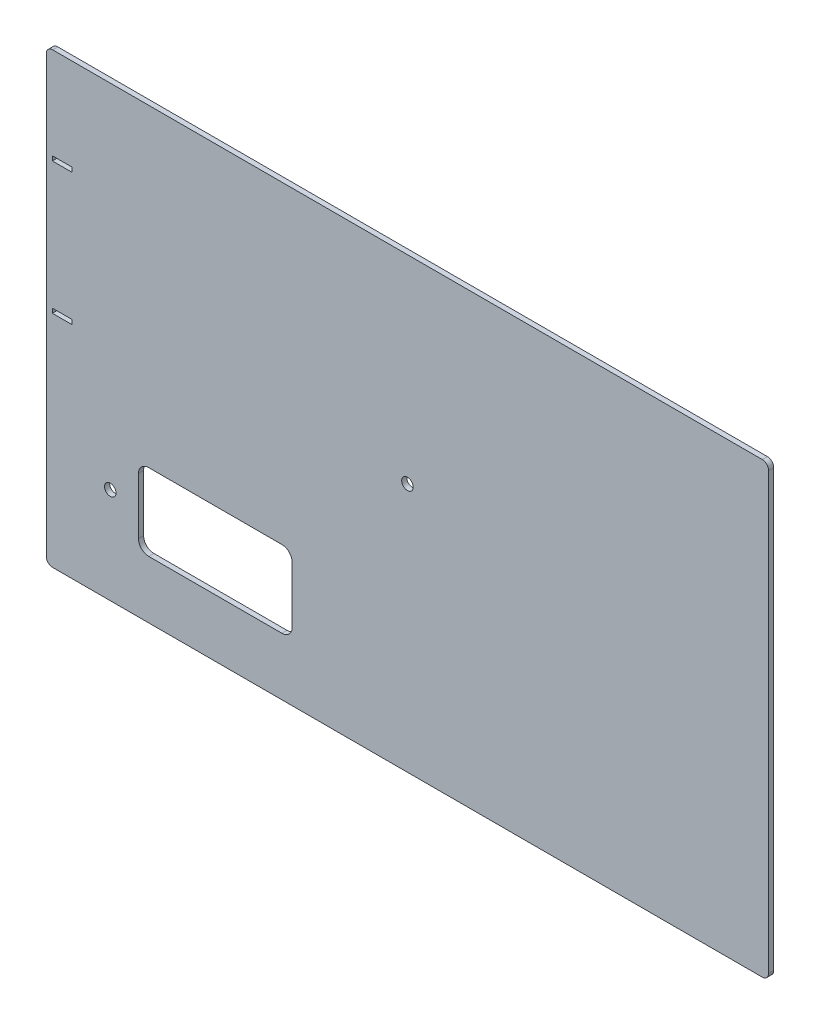
ISO-10303-21;
HEADER;
FILE_DESCRIPTION(('STEP AP214'),'2;1');
FILE_NAME('part.step','',(''),(''),'','','');
FILE_SCHEMA(('AUTOMOTIVE_DESIGN { 1 0 10303 214 1 1 1 1 }'));
ENDSEC;
DATA;
#1=APPLICATION_CONTEXT('core data for automotive mechanical design processes');
#2=APPLICATION_PROTOCOL_DEFINITION('international standard','automotive_design',2000,#1);
#3=PRODUCT_CONTEXT('',#1,'mechanical');
#4=PRODUCT('Part','Part','',(#3));
#5=PRODUCT_RELATED_PRODUCT_CATEGORY('part','',(#4));
#6=PRODUCT_DEFINITION_FORMATION('','',#4);
#7=PRODUCT_DEFINITION_CONTEXT('part definition',#1,'design');
#8=PRODUCT_DEFINITION('design','',#6,#7);
#9=PRODUCT_DEFINITION_SHAPE('','',#8);
#10=(LENGTH_UNIT() NAMED_UNIT(*) SI_UNIT(.MILLI.,.METRE.));
#11=(NAMED_UNIT(*) PLANE_ANGLE_UNIT() SI_UNIT($,.RADIAN.));
#12=(NAMED_UNIT(*) SI_UNIT($,.STERADIAN.) SOLID_ANGLE_UNIT());
#13=UNCERTAINTY_MEASURE_WITH_UNIT(LENGTH_MEASURE(1.E-05),#10,'distance_accuracy_value','');
#14=(GEOMETRIC_REPRESENTATION_CONTEXT(3) GLOBAL_UNCERTAINTY_ASSIGNED_CONTEXT((#13)) GLOBAL_UNIT_ASSIGNED_CONTEXT((#10,
#11,#12)) REPRESENTATION_CONTEXT('',''));
#15=CARTESIAN_POINT('',(0.,0.,0.));
#16=DIRECTION('',(0.,0.,1.));
#17=DIRECTION('',(1.,0.,0.));
#18=AXIS2_PLACEMENT_3D('',#15,#16,#17);
#19=CARTESIAN_POINT('',(0.,0.,-4.));
#20=DIRECTION('',(0.,0.,1.));
#21=DIRECTION('',(1.,0.,0.));
#22=AXIS2_PLACEMENT_3D('',#19,#20,#21);
#23=PLANE('',#22);
#24=CARTESIAN_POINT('',(-261.75,0.249999999999966,-3.99999999999997));
#25=CARTESIAN_POINT('',(-261.75,-3.25000000000003,-3.99999999999997));
#26=B_SPLINE_CURVE_WITH_KNOTS('',1,(#24,#25),.UNSPECIFIED.,.F.,.F.,(2,2),(0.5,
0.592105263157895),.UNSPECIFIED.);
#27=CARTESIAN_POINT('',(-261.75,0.249999999999966,-3.99999999999997));
#28=VERTEX_POINT('',#27);
#29=CARTESIAN_POINT('',(-261.75,-3.25000000000003,-3.99999999999997));
#30=VERTEX_POINT('',#29);
#31=EDGE_CURVE('E224',#28,#30,#26,.T.);
#32=ORIENTED_EDGE('',*,*,#31,.F.);
#33=CARTESIAN_POINT('',(-277.25,0.249999999999966,-3.99999999999997));
#34=CARTESIAN_POINT('',(-261.75,0.249999999999966,-3.99999999999997));
#35=B_SPLINE_CURVE_WITH_KNOTS('',1,(#33,#34),.UNSPECIFIED.,.F.,.F.,(2,2),(0.0921052631578947,
0.5),.UNSPECIFIED.);
#36=CARTESIAN_POINT('',(-277.25,0.249999999999966,-3.99999999999997));
#37=VERTEX_POINT('',#36);
#38=EDGE_CURVE('E217',#37,#28,#35,.T.);
#39=ORIENTED_EDGE('',*,*,#38,.F.);
#40=CARTESIAN_POINT('',(-277.25,-3.25000000000003,-3.99999999999997));
#41=CARTESIAN_POINT('',(-277.25,0.249999999999966,-3.99999999999997));
#42=B_SPLINE_CURVE_WITH_KNOTS('',1,(#40,#41),.UNSPECIFIED.,.F.,.F.,(2,2),(0.,
0.0921052631578947),.UNSPECIFIED.);
#43=CARTESIAN_POINT('',(-277.25,-3.25000000000005,-4.));
#44=VERTEX_POINT('',#43);
#45=EDGE_CURVE('E228',#44,#37,#42,.T.);
#46=ORIENTED_EDGE('',*,*,#45,.F.);
#47=CARTESIAN_POINT('',(-261.75,-3.25000000000003,-3.99999999999997));
#48=CARTESIAN_POINT('',(-277.25,-3.25000000000003,-3.99999999999997));
#49=B_SPLINE_CURVE_WITH_KNOTS('',1,(#47,#48),.UNSPECIFIED.,.F.,.F.,(2,2),(0.592105263157895,1.),.UNSPECIFIED.);
#50=EDGE_CURVE('E55',#30,#44,#49,.T.);
#51=ORIENTED_EDGE('',*,*,#50,.F.);
#52=EDGE_LOOP('',(#32,#39,#46,#51));
#53=FACE_BOUND('',#52,.T.);
#54=DIRECTION('',(1.,0.,0.));
#55=VECTOR('',#54,1.);
#56=CARTESIAN_POINT('',(-282.,-175.,-4.));
#57=LINE('',#56,#55);
#58=CARTESIAN_POINT('',(-277.,-175.,-4.));
#59=VERTEX_POINT('',#58);
#60=CARTESIAN_POINT('',(277.,-175.,-4.));
#61=VERTEX_POINT('',#60);
#62=EDGE_CURVE('E357',#59,#61,#57,.T.);
#63=ORIENTED_EDGE('',*,*,#62,.F.);
#64=CARTESIAN_POINT('',(-277.,-170.,-4.));
#65=DIRECTION('',(0.,0.,1.));
#66=DIRECTION('',(1.,0.,0.));
#67=AXIS2_PLACEMENT_3D('',#64,#65,#66);
#68=CIRCLE('',#67,5.);
#69=CARTESIAN_POINT('',(-282.,-170.,-4.));
#70=VERTEX_POINT('',#69);
#71=EDGE_CURVE('E398',#59,#70,#68,.F.);
#72=ORIENTED_EDGE('',*,*,#71,.T.);
#73=DIRECTION('',(0.,-1.,0.));
#74=VECTOR('',#73,1.);
#75=CARTESIAN_POINT('',(-282.,175.,-4.));
#76=LINE('',#75,#74);
#77=CARTESIAN_POINT('',(-282.,170.,-4.));
#78=VERTEX_POINT('',#77);
#79=EDGE_CURVE('E374',#78,#70,#76,.T.);
#80=ORIENTED_EDGE('',*,*,#79,.F.);
#81=CARTESIAN_POINT('',(-277.,170.,-4.));
#82=DIRECTION('',(0.,0.,1.));
#83=DIRECTION('',(1.,0.,0.));
#84=AXIS2_PLACEMENT_3D('',#81,#82,#83);
#85=CIRCLE('',#84,5.);
#86=CARTESIAN_POINT('',(-277.,175.,-4.));
#87=VERTEX_POINT('',#86);
#88=EDGE_CURVE('E394',#78,#87,#85,.F.);
#89=ORIENTED_EDGE('',*,*,#88,.T.);
#90=DIRECTION('',(-1.,0.,0.));
#91=VECTOR('',#90,1.);
#92=CARTESIAN_POINT('',(-282.,175.,-4.));
#93=LINE('',#92,#91);
#94=CARTESIAN_POINT('',(277.,175.,-4.));
#95=VERTEX_POINT('',#94);
#96=EDGE_CURVE('E356',#95,#87,#93,.T.);
#97=ORIENTED_EDGE('',*,*,#96,.F.);
#98=CARTESIAN_POINT('',(277.,170.,-4.));
#99=DIRECTION('',(0.,0.,1.));
#100=DIRECTION('',(1.,0.,0.));
#101=AXIS2_PLACEMENT_3D('',#98,#99,#100);
#102=CIRCLE('',#101,5.);
#103=CARTESIAN_POINT('',(282.,170.,-4.));
#104=VERTEX_POINT('',#103);
#105=EDGE_CURVE('E392',#95,#104,#102,.F.);
#106=ORIENTED_EDGE('',*,*,#105,.T.);
#107=DIRECTION('',(0.,1.,0.));
#108=VECTOR('',#107,1.);
#109=CARTESIAN_POINT('',(282.,175.,-4.));
#110=LINE('',#109,#108);
#111=CARTESIAN_POINT('',(282.,-170.,-4.));
#112=VERTEX_POINT('',#111);
#113=EDGE_CURVE('E352',#112,#104,#110,.T.);
#114=ORIENTED_EDGE('',*,*,#113,.F.);
#115=CARTESIAN_POINT('',(277.,-170.,-4.));
#116=DIRECTION('',(0.,0.,1.));
#117=DIRECTION('',(1.,0.,0.));
#118=AXIS2_PLACEMENT_3D('',#115,#116,#117);
#119=CIRCLE('',#118,5.);
#120=EDGE_CURVE('E396',#112,#61,#119,.F.);
#121=ORIENTED_EDGE('',*,*,#120,.T.);
#122=EDGE_LOOP('',(#63,#72,#80,#89,#97,#106,#114,#121));
#123=FACE_BOUND('',#122,.T.);
#124=CARTESIAN_POINT('',(-1.11022302462516E-13,20.,-4.));
#125=DIRECTION('',(0.,0.,1.));
#126=DIRECTION('',(1.,0.,0.));
#127=AXIS2_PLACEMENT_3D('',#124,#125,#126);
#128=CIRCLE('',#127,4.5);
#129=CARTESIAN_POINT('',(4.49999999999989,20.,-4.));
#130=VERTEX_POINT('',#129);
#131=EDGE_CURVE('E341',#130,#130,#128,.T.);
#132=ORIENTED_EDGE('',*,*,#131,.T.);
#133=EDGE_LOOP('',(#132));
#134=FACE_BOUND('',#133,.T.);
#135=DIRECTION('',(1.,0.,0.));
#136=VECTOR('',#135,1.);
#137=CARTESIAN_POINT('',(-202.,-70.,-4.));
#138=LINE('',#137,#136);
#139=CARTESIAN_POINT('',(-202.,-70.,-4.));
#140=VERTEX_POINT('',#139);
#141=CARTESIAN_POINT('',(-98.,-70.,-4.));
#142=VERTEX_POINT('',#141);
#143=EDGE_CURVE('E305',#140,#142,#138,.T.);
#144=ORIENTED_EDGE('',*,*,#143,.F.);
#145=CARTESIAN_POINT('',(-202.,-78.,-4.));
#146=DIRECTION('',(0.,0.,-1.));
#147=DIRECTION('',(-1.,0.,0.));
#148=AXIS2_PLACEMENT_3D('',#145,#146,#147);
#149=CIRCLE('',#148,8.00000000000001);
#150=CARTESIAN_POINT('',(-210.,-78.,-4.));
#151=VERTEX_POINT('',#150);
#152=EDGE_CURVE('E300',#151,#140,#149,.T.);
#153=ORIENTED_EDGE('',*,*,#152,.F.);
#154=DIRECTION('',(0.,1.,0.));
#155=VECTOR('',#154,1.);
#156=CARTESIAN_POINT('',(-210.,-122.,-4.));
#157=LINE('',#156,#155);
#158=CARTESIAN_POINT('',(-210.,-122.,-4.));
#159=VERTEX_POINT('',#158);
#160=EDGE_CURVE('E316',#159,#151,#157,.T.);
#161=ORIENTED_EDGE('',*,*,#160,.F.);
#162=CARTESIAN_POINT('',(-202.,-122.,-4.));
#163=DIRECTION('',(0.,0.,-1.));
#164=DIRECTION('',(-1.,0.,0.));
#165=AXIS2_PLACEMENT_3D('',#162,#163,#164);
#166=CIRCLE('',#165,8.00000000000001);
#167=CARTESIAN_POINT('',(-202.,-130.,-4.));
#168=VERTEX_POINT('',#167);
#169=EDGE_CURVE('E321',#168,#159,#166,.T.);
#170=ORIENTED_EDGE('',*,*,#169,.F.);
#171=DIRECTION('',(-1.,0.,0.));
#172=VECTOR('',#171,1.);
#173=CARTESIAN_POINT('',(-98.,-130.,-4.));
#174=LINE('',#173,#172);
#175=CARTESIAN_POINT('',(-98.,-130.,-4.));
#176=VERTEX_POINT('',#175);
#177=EDGE_CURVE('E454',#176,#168,#174,.T.);
#178=ORIENTED_EDGE('',*,*,#177,.F.);
#179=CARTESIAN_POINT('',(-98.,-122.,-4.));
#180=DIRECTION('',(0.,0.,-1.));
#181=DIRECTION('',(-1.,0.,0.));
#182=AXIS2_PLACEMENT_3D('',#179,#180,#181);
#183=CIRCLE('',#182,8.00000000000001);
#184=CARTESIAN_POINT('',(-90.,-122.,-4.));
#185=VERTEX_POINT('',#184);
#186=EDGE_CURVE('E449',#185,#176,#183,.T.);
#187=ORIENTED_EDGE('',*,*,#186,.F.);
#188=DIRECTION('',(0.,-1.,0.));
#189=VECTOR('',#188,1.);
#190=CARTESIAN_POINT('',(-90.,-78.,-4.));
#191=LINE('',#190,#189);
#192=CARTESIAN_POINT('',(-90.,-78.,-4.));
#193=VERTEX_POINT('',#192);
#194=EDGE_CURVE('E455',#193,#185,#191,.T.);
#195=ORIENTED_EDGE('',*,*,#194,.F.);
#196=CARTESIAN_POINT('',(-98.,-78.,-4.));
#197=DIRECTION('',(0.,0.,-1.));
#198=DIRECTION('',(-1.,0.,0.));
#199=AXIS2_PLACEMENT_3D('',#196,#197,#198);
#200=CIRCLE('',#199,8.00000000000001);
#201=EDGE_CURVE('E465',#142,#193,#200,.T.);
#202=ORIENTED_EDGE('',*,*,#201,.F.);
#203=EDGE_LOOP('',(#144,#153,#161,#170,#178,#187,#195,#202));
#204=FACE_BOUND('',#203,.T.);
#205=CARTESIAN_POINT('',(-232.,-100.,-4.));
#206=DIRECTION('',(0.,0.,-1.));
#207=DIRECTION('',(-1.,0.,0.));
#208=AXIS2_PLACEMENT_3D('',#205,#206,#207);
#209=CIRCLE('',#208,4.50000000000002);
#210=CARTESIAN_POINT('',(-236.5,-100.,-4.));
#211=VERTEX_POINT('',#210);
#212=EDGE_CURVE('E296',#211,#211,#209,.T.);
#213=ORIENTED_EDGE('',*,*,#212,.F.);
#214=EDGE_LOOP('',(#213));
#215=FACE_BOUND('',#214,.T.);
#216=CARTESIAN_POINT('',(-277.25,103.25,-3.99999999999993));
#217=CARTESIAN_POINT('',(-277.25,99.75,-3.99999999999993));
#218=B_SPLINE_CURVE_WITH_KNOTS('',1,(#216,#217),.UNSPECIFIED.,.F.,.F.,(2,2),(0.,
0.0921052631578947),.UNSPECIFIED.);
#219=CARTESIAN_POINT('',(-277.25,103.25,-4.));
#220=VERTEX_POINT('',#219);
#221=CARTESIAN_POINT('',(-277.25,99.75,-3.99999999999993));
#222=VERTEX_POINT('',#221);
#223=EDGE_CURVE('E271',#220,#222,#218,.T.);
#224=ORIENTED_EDGE('',*,*,#223,.T.);
#225=CARTESIAN_POINT('',(-277.25,99.75,-3.99999999999993));
#226=CARTESIAN_POINT('',(-261.75,99.75,-3.99999999999993));
#227=B_SPLINE_CURVE_WITH_KNOTS('',1,(#225,#226),.UNSPECIFIED.,.F.,.F.,(2,2),(0.0921052631578947,
0.5),.UNSPECIFIED.);
#228=CARTESIAN_POINT('',(-261.75,99.75,-3.99999999999993));
#229=VERTEX_POINT('',#228);
#230=EDGE_CURVE('E258',#222,#229,#227,.T.);
#231=ORIENTED_EDGE('',*,*,#230,.T.);
#232=CARTESIAN_POINT('',(-261.75,99.75,-3.99999999999993));
#233=CARTESIAN_POINT('',(-261.75,103.25,-3.99999999999993));
#234=B_SPLINE_CURVE_WITH_KNOTS('',1,(#232,#233),.UNSPECIFIED.,.F.,.F.,(2,2),(0.5,
0.592105263157895),.UNSPECIFIED.);
#235=CARTESIAN_POINT('',(-261.75,103.25,-3.99999999999993));
#236=VERTEX_POINT('',#235);
#237=EDGE_CURVE('E248',#229,#236,#234,.T.);
#238=ORIENTED_EDGE('',*,*,#237,.T.);
#239=CARTESIAN_POINT('',(-261.75,103.25,-3.99999999999993));
#240=CARTESIAN_POINT('',(-277.25,103.25,-3.99999999999993));
#241=B_SPLINE_CURVE_WITH_KNOTS('',1,(#239,#240),.UNSPECIFIED.,.F.,.F.,(2,2),(0.592105263157895,
1.),.UNSPECIFIED.);
#242=EDGE_CURVE('E240',#236,#220,#241,.T.);
#243=ORIENTED_EDGE('',*,*,#242,.T.);
#244=EDGE_LOOP('',(#224,#231,#238,#243));
#245=FACE_BOUND('',#244,.T.);
#246=ADVANCED_FACE('F40',(#53,#123,#134,#204,#215,#245),#23,.F.);
#247=CARTESIAN_POINT('',(0.,0.,0.));
#248=DIRECTION('',(0.,0.,1.));
#249=DIRECTION('',(1.,0.,0.));
#250=AXIS2_PLACEMENT_3D('',#247,#248,#249);
#251=PLANE('',#250);
#252=DIRECTION('',(1.,0.,0.));
#253=VECTOR('',#252,1.);
#254=CARTESIAN_POINT('',(-277.25,0.249999999999954,0.));
#255=LINE('',#254,#253);
#256=CARTESIAN_POINT('',(-277.25,0.249999999999966,0.));
#257=VERTEX_POINT('',#256);
#258=CARTESIAN_POINT('',(-261.75,0.249999999999954,0.));
#259=VERTEX_POINT('',#258);
#260=EDGE_CURVE('E214',#257,#259,#255,.T.);
#261=ORIENTED_EDGE('',*,*,#260,.T.);
#262=DIRECTION('',(0.,-1.,0.));
#263=VECTOR('',#262,1.);
#264=CARTESIAN_POINT('',(-261.75,0.249999999999943,0.));
#265=LINE('',#264,#263);
#266=CARTESIAN_POINT('',(-261.75,-3.25000000000006,0.));
#267=VERTEX_POINT('',#266);
#268=EDGE_CURVE('E201',#259,#267,#265,.T.);
#269=ORIENTED_EDGE('',*,*,#268,.T.);
#270=DIRECTION('',(-1.,0.,0.));
#271=VECTOR('',#270,1.);
#272=CARTESIAN_POINT('',(-261.75,-3.25000000000005,0.));
#273=LINE('',#272,#271);
#274=CARTESIAN_POINT('',(-277.25,-3.25000000000005,0.));
#275=VERTEX_POINT('',#274);
#276=EDGE_CURVE('E235',#267,#275,#273,.T.);
#277=ORIENTED_EDGE('',*,*,#276,.T.);
#278=DIRECTION('',(0.,1.,0.));
#279=VECTOR('',#278,1.);
#280=CARTESIAN_POINT('',(-277.25,-3.25000000000006,0.));
#281=LINE('',#280,#279);
#282=EDGE_CURVE('E222',#275,#257,#281,.T.);
#283=ORIENTED_EDGE('',*,*,#282,.T.);
#284=EDGE_LOOP('',(#261,#269,#277,#283));
#285=FACE_BOUND('',#284,.T.);
#286=CARTESIAN_POINT('',(-232.,-100.,0.));
#287=DIRECTION('',(0.,0.,1.));
#288=DIRECTION('',(1.,0.,0.));
#289=AXIS2_PLACEMENT_3D('',#286,#287,#288);
#290=CIRCLE('',#289,4.50000000000002);
#291=CARTESIAN_POINT('',(-227.5,-100.,0.));
#292=VERTEX_POINT('',#291);
#293=EDGE_CURVE('E283',#292,#292,#290,.F.);
#294=ORIENTED_EDGE('',*,*,#293,.T.);
#295=EDGE_LOOP('',(#294));
#296=FACE_BOUND('',#295,.T.);
#297=CARTESIAN_POINT('',(-202.,-78.,0.));
#298=DIRECTION('',(0.,0.,1.));
#299=DIRECTION('',(1.,0.,0.));
#300=AXIS2_PLACEMENT_3D('',#297,#298,#299);
#301=CIRCLE('',#300,8.00000000000001);
#302=CARTESIAN_POINT('',(-202.,-70.,0.));
#303=VERTEX_POINT('',#302);
#304=CARTESIAN_POINT('',(-210.,-78.,0.));
#305=VERTEX_POINT('',#304);
#306=EDGE_CURVE('E12',#303,#305,#301,.T.);
#307=ORIENTED_EDGE('',*,*,#306,.F.);
#308=DIRECTION('',(-1.,0.,0.));
#309=VECTOR('',#308,1.);
#310=CARTESIAN_POINT('',(0.,-70.,0.));
#311=LINE('',#310,#309);
#312=CARTESIAN_POINT('',(-98.,-70.,0.));
#313=VERTEX_POINT('',#312);
#314=EDGE_CURVE('E410',#313,#303,#311,.T.);
#315=ORIENTED_EDGE('',*,*,#314,.F.);
#316=CARTESIAN_POINT('',(-98.,-78.,0.));
#317=DIRECTION('',(0.,0.,1.));
#318=DIRECTION('',(1.,0.,0.));
#319=AXIS2_PLACEMENT_3D('',#316,#317,#318);
#320=CIRCLE('',#319,8.00000000000001);
#321=CARTESIAN_POINT('',(-90.,-78.,0.));
#322=VERTEX_POINT('',#321);
#323=EDGE_CURVE('E412',#322,#313,#320,.T.);
#324=ORIENTED_EDGE('',*,*,#323,.F.);
#325=DIRECTION('',(0.,1.,0.));
#326=VECTOR('',#325,1.);
#327=CARTESIAN_POINT('',(-90.,0.,0.));
#328=LINE('',#327,#326);
#329=CARTESIAN_POINT('',(-90.,-122.,0.));
#330=VERTEX_POINT('',#329);
#331=EDGE_CURVE('E415',#330,#322,#328,.T.);
#332=ORIENTED_EDGE('',*,*,#331,.F.);
#333=CARTESIAN_POINT('',(-98.,-122.,0.));
#334=DIRECTION('',(0.,0.,1.));
#335=DIRECTION('',(1.,0.,0.));
#336=AXIS2_PLACEMENT_3D('',#333,#334,#335);
#337=CIRCLE('',#336,8.00000000000001);
#338=CARTESIAN_POINT('',(-98.,-130.,0.));
#339=VERTEX_POINT('',#338);
#340=EDGE_CURVE('E417',#339,#330,#337,.T.);
#341=ORIENTED_EDGE('',*,*,#340,.F.);
#342=DIRECTION('',(1.,0.,0.));
#343=VECTOR('',#342,1.);
#344=CARTESIAN_POINT('',(0.,-130.,0.));
#345=LINE('',#344,#343);
#346=CARTESIAN_POINT('',(-202.,-130.,0.));
#347=VERTEX_POINT('',#346);
#348=EDGE_CURVE('E419',#347,#339,#345,.T.);
#349=ORIENTED_EDGE('',*,*,#348,.F.);
#350=CARTESIAN_POINT('',(-202.,-122.,0.));
#351=DIRECTION('',(0.,0.,1.));
#352=DIRECTION('',(1.,0.,0.));
#353=AXIS2_PLACEMENT_3D('',#350,#351,#352);
#354=CIRCLE('',#353,8.00000000000001);
#355=CARTESIAN_POINT('',(-210.,-122.,0.));
#356=VERTEX_POINT('',#355);
#357=EDGE_CURVE('E421',#356,#347,#354,.T.);
#358=ORIENTED_EDGE('',*,*,#357,.F.);
#359=DIRECTION('',(0.,-1.,0.));
#360=VECTOR('',#359,1.);
#361=CARTESIAN_POINT('',(-210.,0.,0.));
#362=LINE('',#361,#360);
#363=EDGE_CURVE('E48',#305,#356,#362,.T.);
#364=ORIENTED_EDGE('',*,*,#363,.F.);
#365=EDGE_LOOP('',(#307,#315,#324,#332,#341,#349,#358,#364));
#366=FACE_BOUND('',#365,.T.);
#367=CARTESIAN_POINT('',(-1.11022302462516E-13,20.,0.));
#368=DIRECTION('',(0.,0.,1.));
#369=DIRECTION('',(1.,0.,0.));
#370=AXIS2_PLACEMENT_3D('',#367,#368,#369);
#371=CIRCLE('',#370,4.5);
#372=CARTESIAN_POINT('',(4.49999999999989,20.,0.));
#373=VERTEX_POINT('',#372);
#374=EDGE_CURVE('E326',#373,#373,#371,.T.);
#375=ORIENTED_EDGE('',*,*,#374,.F.);
#376=EDGE_LOOP('',(#375));
#377=FACE_BOUND('',#376,.T.);
#378=DIRECTION('',(0.,-1.,0.));
#379=VECTOR('',#378,1.);
#380=CARTESIAN_POINT('',(-282.,175.,0.));
#381=LINE('',#380,#379);
#382=CARTESIAN_POINT('',(-282.,170.,0.));
#383=VERTEX_POINT('',#382);
#384=CARTESIAN_POINT('',(-282.,-170.,0.));
#385=VERTEX_POINT('',#384);
#386=EDGE_CURVE('E345',#383,#385,#381,.T.);
#387=ORIENTED_EDGE('',*,*,#386,.T.);
#388=CARTESIAN_POINT('',(-277.,-170.,0.));
#389=DIRECTION('',(0.,0.,1.));
#390=DIRECTION('',(1.,0.,0.));
#391=AXIS2_PLACEMENT_3D('',#388,#389,#390);
#392=CIRCLE('',#391,5.);
#393=CARTESIAN_POINT('',(-277.,-175.,0.));
#394=VERTEX_POINT('',#393);
#395=EDGE_CURVE('E385',#385,#394,#392,.T.);
#396=ORIENTED_EDGE('',*,*,#395,.T.);
#397=DIRECTION('',(1.,0.,0.));
#398=VECTOR('',#397,1.);
#399=CARTESIAN_POINT('',(-282.,-175.,0.));
#400=LINE('',#399,#398);
#401=CARTESIAN_POINT('',(277.,-175.,0.));
#402=VERTEX_POINT('',#401);
#403=EDGE_CURVE('E365',#394,#402,#400,.T.);
#404=ORIENTED_EDGE('',*,*,#403,.T.);
#405=CARTESIAN_POINT('',(277.,-170.,0.));
#406=DIRECTION('',(0.,0.,1.));
#407=DIRECTION('',(1.,0.,0.));
#408=AXIS2_PLACEMENT_3D('',#405,#406,#407);
#409=CIRCLE('',#408,5.);
#410=CARTESIAN_POINT('',(282.,-170.,0.));
#411=VERTEX_POINT('',#410);
#412=EDGE_CURVE('E383',#402,#411,#409,.T.);
#413=ORIENTED_EDGE('',*,*,#412,.T.);
#414=DIRECTION('',(0.,1.,0.));
#415=VECTOR('',#414,1.);
#416=CARTESIAN_POINT('',(282.,175.,0.));
#417=LINE('',#416,#415);
#418=CARTESIAN_POINT('',(282.,170.,0.));
#419=VERTEX_POINT('',#418);
#420=EDGE_CURVE('E368',#411,#419,#417,.T.);
#421=ORIENTED_EDGE('',*,*,#420,.T.);
#422=CARTESIAN_POINT('',(277.,170.,0.));
#423=DIRECTION('',(0.,0.,1.));
#424=DIRECTION('',(1.,0.,0.));
#425=AXIS2_PLACEMENT_3D('',#422,#423,#424);
#426=CIRCLE('',#425,5.);
#427=CARTESIAN_POINT('',(277.,175.,0.));
#428=VERTEX_POINT('',#427);
#429=EDGE_CURVE('E379',#419,#428,#426,.T.);
#430=ORIENTED_EDGE('',*,*,#429,.T.);
#431=DIRECTION('',(-1.,0.,0.));
#432=VECTOR('',#431,1.);
#433=CARTESIAN_POINT('',(-282.,175.,0.));
#434=LINE('',#433,#432);
#435=CARTESIAN_POINT('',(-277.,175.,0.));
#436=VERTEX_POINT('',#435);
#437=EDGE_CURVE('E371',#428,#436,#434,.T.);
#438=ORIENTED_EDGE('',*,*,#437,.T.);
#439=CARTESIAN_POINT('',(-277.,170.,0.));
#440=DIRECTION('',(0.,0.,1.));
#441=DIRECTION('',(1.,0.,0.));
#442=AXIS2_PLACEMENT_3D('',#439,#440,#441);
#443=CIRCLE('',#442,5.);
#444=EDGE_CURVE('E381',#436,#383,#443,.T.);
#445=ORIENTED_EDGE('',*,*,#444,.T.);
#446=EDGE_LOOP('',(#387,#396,#404,#413,#421,#430,#438,#445));
#447=FACE_BOUND('',#446,.T.);
#448=DIRECTION('',(1.,0.,0.));
#449=VECTOR('',#448,1.);
#450=CARTESIAN_POINT('',(-277.25,99.75,0.));
#451=LINE('',#450,#449);
#452=CARTESIAN_POINT('',(-277.25,99.75,0.));
#453=VERTEX_POINT('',#452);
#454=CARTESIAN_POINT('',(-261.75,99.75,0.));
#455=VERTEX_POINT('',#454);
#456=EDGE_CURVE('E284',#453,#455,#451,.T.);
#457=ORIENTED_EDGE('',*,*,#456,.F.);
#458=DIRECTION('',(0.,-1.,0.));
#459=VECTOR('',#458,1.);
#460=CARTESIAN_POINT('',(-277.25,103.25,0.));
#461=LINE('',#460,#459);
#462=CARTESIAN_POINT('',(-277.25,103.25,0.));
#463=VERTEX_POINT('',#462);
#464=EDGE_CURVE('E287',#463,#453,#461,.T.);
#465=ORIENTED_EDGE('',*,*,#464,.F.);
#466=DIRECTION('',(-1.,0.,0.));
#467=VECTOR('',#466,1.);
#468=CARTESIAN_POINT('',(-261.75,103.25,0.));
#469=LINE('',#468,#467);
#470=CARTESIAN_POINT('',(-261.75,103.25,0.));
#471=VERTEX_POINT('',#470);
#472=EDGE_CURVE('E246',#471,#463,#469,.T.);
#473=ORIENTED_EDGE('',*,*,#472,.F.);
#474=DIRECTION('',(0.,1.,0.));
#475=VECTOR('',#474,1.);
#476=CARTESIAN_POINT('',(-261.75,99.75,0.));
#477=LINE('',#476,#475);
#478=EDGE_CURVE('E278',#455,#471,#477,.T.);
#479=ORIENTED_EDGE('',*,*,#478,.F.);
#480=EDGE_LOOP('',(#457,#465,#473,#479));
#481=FACE_BOUND('',#480,.T.);
#482=ADVANCED_FACE('F220',(#285,#296,#366,#377,#447,#481),#251,.T.);
#483=CARTESIAN_POINT('',(-282.,175.,-4.));
#484=DIRECTION('',(-1.,0.,0.));
#485=DIRECTION('',(0.,-1.,0.));
#486=AXIS2_PLACEMENT_3D('',#483,#484,#485);
#487=PLANE('',#486);
#488=ORIENTED_EDGE('',*,*,#79,.T.);
#489=DIRECTION('',(0.,0.,1.));
#490=VECTOR('',#489,1.);
#491=CARTESIAN_POINT('',(-282.,-170.,-4.));
#492=LINE('',#491,#490);
#493=EDGE_CURVE('E376',#70,#385,#492,.T.);
#494=ORIENTED_EDGE('',*,*,#493,.T.);
#495=ORIENTED_EDGE('',*,*,#386,.F.);
#496=DIRECTION('',(0.,0.,1.));
#497=VECTOR('',#496,1.);
#498=CARTESIAN_POINT('',(-282.,170.,-4.));
#499=LINE('',#498,#497);
#500=EDGE_CURVE('E362',#383,#78,#499,.F.);
#501=ORIENTED_EDGE('',*,*,#500,.T.);
#502=EDGE_LOOP('',(#488,#494,#495,#501));
#503=FACE_BOUND('',#502,.T.);
#504=ADVANCED_FACE('F500',(#503),#487,.T.);
#505=CARTESIAN_POINT('',(-282.,175.,-4.));
#506=DIRECTION('',(0.,1.,0.));
#507=DIRECTION('',(0.,0.,1.));
#508=AXIS2_PLACEMENT_3D('',#505,#506,#507);
#509=PLANE('',#508);
#510=ORIENTED_EDGE('',*,*,#96,.T.);
#511=DIRECTION('',(0.,0.,1.));
#512=VECTOR('',#511,1.);
#513=CARTESIAN_POINT('',(-277.,175.,-4.));
#514=LINE('',#513,#512);
#515=EDGE_CURVE('E407',#87,#436,#514,.T.);
#516=ORIENTED_EDGE('',*,*,#515,.T.);
#517=ORIENTED_EDGE('',*,*,#437,.F.);
#518=DIRECTION('',(0.,0.,1.));
#519=VECTOR('',#518,1.);
#520=CARTESIAN_POINT('',(277.,175.,-4.));
#521=LINE('',#520,#519);
#522=EDGE_CURVE('E405',#428,#95,#521,.F.);
#523=ORIENTED_EDGE('',*,*,#522,.T.);
#524=EDGE_LOOP('',(#510,#516,#517,#523));
#525=FACE_BOUND('',#524,.T.);
#526=ADVANCED_FACE('F505',(#525),#509,.T.);
#527=CARTESIAN_POINT('',(282.,175.,-4.));
#528=DIRECTION('',(1.,0.,0.));
#529=DIRECTION('',(0.,1.,0.));
#530=AXIS2_PLACEMENT_3D('',#527,#528,#529);
#531=PLANE('',#530);
#532=ORIENTED_EDGE('',*,*,#420,.F.);
#533=DIRECTION('',(0.,0.,1.));
#534=VECTOR('',#533,1.);
#535=CARTESIAN_POINT('',(282.,-170.,-4.));
#536=LINE('',#535,#534);
#537=EDGE_CURVE('E403',#411,#112,#536,.F.);
#538=ORIENTED_EDGE('',*,*,#537,.T.);
#539=ORIENTED_EDGE('',*,*,#113,.T.);
#540=DIRECTION('',(0.,0.,1.));
#541=VECTOR('',#540,1.);
#542=CARTESIAN_POINT('',(282.,170.,-4.));
#543=LINE('',#542,#541);
#544=EDGE_CURVE('E400',#104,#419,#543,.T.);
#545=ORIENTED_EDGE('',*,*,#544,.T.);
#546=EDGE_LOOP('',(#532,#538,#539,#545));
#547=FACE_BOUND('',#546,.T.);
#548=ADVANCED_FACE('F508',(#547),#531,.T.);
#549=CARTESIAN_POINT('',(-282.,-175.,-4.));
#550=DIRECTION('',(0.,-1.,0.));
#551=DIRECTION('',(0.,0.,-1.));
#552=AXIS2_PLACEMENT_3D('',#549,#550,#551);
#553=PLANE('',#552);
#554=ORIENTED_EDGE('',*,*,#403,.F.);
#555=DIRECTION('',(0.,0.,1.));
#556=VECTOR('',#555,1.);
#557=CARTESIAN_POINT('',(-277.,-175.,-4.));
#558=LINE('',#557,#556);
#559=EDGE_CURVE('E390',#394,#59,#558,.F.);
#560=ORIENTED_EDGE('',*,*,#559,.T.);
#561=ORIENTED_EDGE('',*,*,#62,.T.);
#562=DIRECTION('',(0.,0.,1.));
#563=VECTOR('',#562,1.);
#564=CARTESIAN_POINT('',(277.,-175.,-4.));
#565=LINE('',#564,#563);
#566=EDGE_CURVE('E387',#61,#402,#565,.T.);
#567=ORIENTED_EDGE('',*,*,#566,.T.);
#568=EDGE_LOOP('',(#554,#560,#561,#567));
#569=FACE_BOUND('',#568,.T.);
#570=ADVANCED_FACE('F512',(#569),#553,.T.);
#571=CARTESIAN_POINT('',(-1.11022302462516E-13,20.,-4.));
#572=DIRECTION('',(0.,0.,1.));
#573=DIRECTION('',(1.,0.,0.));
#574=AXIS2_PLACEMENT_3D('',#571,#572,#573);
#575=CYLINDRICAL_SURFACE('',#574,4.5);
#576=ORIENTED_EDGE('',*,*,#131,.F.);
#577=EDGE_LOOP('',(#576));
#578=FACE_BOUND('',#577,.T.);
#579=ORIENTED_EDGE('',*,*,#374,.T.);
#580=EDGE_LOOP('',(#579));
#581=FACE_BOUND('',#580,.T.);
#582=ADVANCED_FACE('F503',(#578,#581),#575,.F.);
#583=CARTESIAN_POINT('',(-277.,-170.,-4.));
#584=DIRECTION('',(0.,0.,1.));
#585=DIRECTION('',(1.,0.,0.));
#586=AXIS2_PLACEMENT_3D('',#583,#584,#585);
#587=CYLINDRICAL_SURFACE('',#586,5.);
#588=ORIENTED_EDGE('',*,*,#71,.F.);
#589=ORIENTED_EDGE('',*,*,#559,.F.);
#590=ORIENTED_EDGE('',*,*,#395,.F.);
#591=ORIENTED_EDGE('',*,*,#493,.F.);
#592=EDGE_LOOP('',(#588,#589,#590,#591));
#593=FACE_BOUND('',#592,.T.);
#594=ADVANCED_FACE('F520',(#593),#587,.T.);
#595=CARTESIAN_POINT('',(277.,-170.,-4.));
#596=DIRECTION('',(0.,0.,1.));
#597=DIRECTION('',(1.,0.,0.));
#598=AXIS2_PLACEMENT_3D('',#595,#596,#597);
#599=CYLINDRICAL_SURFACE('',#598,5.);
#600=ORIENTED_EDGE('',*,*,#120,.F.);
#601=ORIENTED_EDGE('',*,*,#537,.F.);
#602=ORIENTED_EDGE('',*,*,#412,.F.);
#603=ORIENTED_EDGE('',*,*,#566,.F.);
#604=EDGE_LOOP('',(#600,#601,#602,#603));
#605=FACE_BOUND('',#604,.T.);
#606=ADVANCED_FACE('F523',(#605),#599,.T.);
#607=CARTESIAN_POINT('',(-277.,170.,-4.));
#608=DIRECTION('',(0.,0.,1.));
#609=DIRECTION('',(1.,0.,0.));
#610=AXIS2_PLACEMENT_3D('',#607,#608,#609);
#611=CYLINDRICAL_SURFACE('',#610,5.);
#612=ORIENTED_EDGE('',*,*,#88,.F.);
#613=ORIENTED_EDGE('',*,*,#500,.F.);
#614=ORIENTED_EDGE('',*,*,#444,.F.);
#615=ORIENTED_EDGE('',*,*,#515,.F.);
#616=EDGE_LOOP('',(#612,#613,#614,#615));
#617=FACE_BOUND('',#616,.T.);
#618=ADVANCED_FACE('F490',(#617),#611,.T.);
#619=CARTESIAN_POINT('',(277.,170.,-4.));
#620=DIRECTION('',(0.,0.,1.));
#621=DIRECTION('',(1.,0.,0.));
#622=AXIS2_PLACEMENT_3D('',#619,#620,#621);
#623=CYLINDRICAL_SURFACE('',#622,5.);
#624=ORIENTED_EDGE('',*,*,#105,.F.);
#625=ORIENTED_EDGE('',*,*,#522,.F.);
#626=ORIENTED_EDGE('',*,*,#429,.F.);
#627=ORIENTED_EDGE('',*,*,#544,.F.);
#628=EDGE_LOOP('',(#624,#625,#626,#627));
#629=FACE_BOUND('',#628,.T.);
#630=ADVANCED_FACE('F42',(#629),#623,.T.);
#631=CARTESIAN_POINT('',(-202.,-78.,34.));
#632=DIRECTION('',(0.,0.,-1.));
#633=DIRECTION('',(-1.,0.,0.));
#634=AXIS2_PLACEMENT_3D('',#631,#632,#633);
#635=CYLINDRICAL_SURFACE('',#634,8.00000000000001);
#636=ORIENTED_EDGE('',*,*,#306,.T.);
#637=DIRECTION('',(0.,0.,-1.));
#638=VECTOR('',#637,1.);
#639=CARTESIAN_POINT('',(-210.,-78.,34.));
#640=LINE('',#639,#638);
#641=EDGE_CURVE('E324',#305,#151,#640,.T.);
#642=ORIENTED_EDGE('',*,*,#641,.T.);
#643=ORIENTED_EDGE('',*,*,#152,.T.);
#644=DIRECTION('',(0.,0.,-1.));
#645=VECTOR('',#644,1.);
#646=CARTESIAN_POINT('',(-202.,-70.,34.));
#647=LINE('',#646,#645);
#648=EDGE_CURVE('E320',#303,#140,#647,.T.);
#649=ORIENTED_EDGE('',*,*,#648,.F.);
#650=EDGE_LOOP('',(#636,#642,#643,#649));
#651=FACE_BOUND('',#650,.T.);
#652=ADVANCED_FACE('F482',(#651),#635,.F.);
#653=CARTESIAN_POINT('',(-210.,-122.,34.));
#654=DIRECTION('',(-1.,0.,0.));
#655=DIRECTION('',(0.,0.,1.));
#656=AXIS2_PLACEMENT_3D('',#653,#654,#655);
#657=PLANE('',#656);
#658=ORIENTED_EDGE('',*,*,#363,.T.);
#659=DIRECTION('',(0.,0.,-1.));
#660=VECTOR('',#659,1.);
#661=CARTESIAN_POINT('',(-210.,-122.,34.));
#662=LINE('',#661,#660);
#663=EDGE_CURVE('E327',#356,#159,#662,.T.);
#664=ORIENTED_EDGE('',*,*,#663,.T.);
#665=ORIENTED_EDGE('',*,*,#160,.T.);
#666=ORIENTED_EDGE('',*,*,#641,.F.);
#667=EDGE_LOOP('',(#658,#664,#665,#666));
#668=FACE_BOUND('',#667,.T.);
#669=ADVANCED_FACE('F426',(#668),#657,.F.);
#670=CARTESIAN_POINT('',(-202.,-122.,34.));
#671=DIRECTION('',(0.,0.,-1.));
#672=DIRECTION('',(-1.,0.,0.));
#673=AXIS2_PLACEMENT_3D('',#670,#671,#672);
#674=CYLINDRICAL_SURFACE('',#673,8.00000000000001);
#675=ORIENTED_EDGE('',*,*,#357,.T.);
#676=DIRECTION('',(0.,0.,-1.));
#677=VECTOR('',#676,1.);
#678=CARTESIAN_POINT('',(-202.,-130.,34.));
#679=LINE('',#678,#677);
#680=EDGE_CURVE('E329',#347,#168,#679,.T.);
#681=ORIENTED_EDGE('',*,*,#680,.T.);
#682=ORIENTED_EDGE('',*,*,#169,.T.);
#683=ORIENTED_EDGE('',*,*,#663,.F.);
#684=EDGE_LOOP('',(#675,#681,#682,#683));
#685=FACE_BOUND('',#684,.T.);
#686=ADVANCED_FACE('F432',(#685),#674,.F.);
#687=CARTESIAN_POINT('',(-98.,-130.,34.));
#688=DIRECTION('',(0.,-1.,0.));
#689=DIRECTION('',(0.,0.,-1.));
#690=AXIS2_PLACEMENT_3D('',#687,#688,#689);
#691=PLANE('',#690);
#692=ORIENTED_EDGE('',*,*,#348,.T.);
#693=DIRECTION('',(0.,0.,-1.));
#694=VECTOR('',#693,1.);
#695=CARTESIAN_POINT('',(-98.,-130.,34.));
#696=LINE('',#695,#694);
#697=EDGE_CURVE('E331',#339,#176,#696,.T.);
#698=ORIENTED_EDGE('',*,*,#697,.T.);
#699=ORIENTED_EDGE('',*,*,#177,.T.);
#700=ORIENTED_EDGE('',*,*,#680,.F.);
#701=EDGE_LOOP('',(#692,#698,#699,#700));
#702=FACE_BOUND('',#701,.T.);
#703=ADVANCED_FACE('F442',(#702),#691,.F.);
#704=CARTESIAN_POINT('',(-98.,-122.,34.));
#705=DIRECTION('',(0.,0.,-1.));
#706=DIRECTION('',(-1.,0.,0.));
#707=AXIS2_PLACEMENT_3D('',#704,#705,#706);
#708=CYLINDRICAL_SURFACE('',#707,8.00000000000001);
#709=ORIENTED_EDGE('',*,*,#340,.T.);
#710=DIRECTION('',(0.,0.,-1.));
#711=VECTOR('',#710,1.);
#712=CARTESIAN_POINT('',(-90.,-122.,34.));
#713=LINE('',#712,#711);
#714=EDGE_CURVE('E333',#330,#185,#713,.T.);
#715=ORIENTED_EDGE('',*,*,#714,.T.);
#716=ORIENTED_EDGE('',*,*,#186,.T.);
#717=ORIENTED_EDGE('',*,*,#697,.F.);
#718=EDGE_LOOP('',(#709,#715,#716,#717));
#719=FACE_BOUND('',#718,.T.);
#720=ADVANCED_FACE('F446',(#719),#708,.F.);
#721=CARTESIAN_POINT('',(-90.,-78.,34.));
#722=DIRECTION('',(1.,0.,0.));
#723=DIRECTION('',(0.,0.,-1.));
#724=AXIS2_PLACEMENT_3D('',#721,#722,#723);
#725=PLANE('',#724);
#726=ORIENTED_EDGE('',*,*,#331,.T.);
#727=DIRECTION('',(0.,0.,-1.));
#728=VECTOR('',#727,1.);
#729=CARTESIAN_POINT('',(-90.,-78.,34.));
#730=LINE('',#729,#728);
#731=EDGE_CURVE('E335',#322,#193,#730,.T.);
#732=ORIENTED_EDGE('',*,*,#731,.T.);
#733=ORIENTED_EDGE('',*,*,#194,.T.);
#734=ORIENTED_EDGE('',*,*,#714,.F.);
#735=EDGE_LOOP('',(#726,#732,#733,#734));
#736=FACE_BOUND('',#735,.T.);
#737=ADVANCED_FACE('F477',(#736),#725,.F.);
#738=CARTESIAN_POINT('',(-98.,-78.,34.));
#739=DIRECTION('',(0.,0.,-1.));
#740=DIRECTION('',(-1.,0.,0.));
#741=AXIS2_PLACEMENT_3D('',#738,#739,#740);
#742=CYLINDRICAL_SURFACE('',#741,8.00000000000001);
#743=ORIENTED_EDGE('',*,*,#323,.T.);
#744=DIRECTION('',(0.,0.,-1.));
#745=VECTOR('',#744,1.);
#746=CARTESIAN_POINT('',(-98.,-70.,34.));
#747=LINE('',#746,#745);
#748=EDGE_CURVE('E337',#313,#142,#747,.T.);
#749=ORIENTED_EDGE('',*,*,#748,.T.);
#750=ORIENTED_EDGE('',*,*,#201,.T.);
#751=ORIENTED_EDGE('',*,*,#731,.F.);
#752=EDGE_LOOP('',(#743,#749,#750,#751));
#753=FACE_BOUND('',#752,.T.);
#754=ADVANCED_FACE('F479',(#753),#742,.F.);
#755=CARTESIAN_POINT('',(-202.,-70.,34.));
#756=DIRECTION('',(0.,1.,0.));
#757=DIRECTION('',(0.,0.,1.));
#758=AXIS2_PLACEMENT_3D('',#755,#756,#757);
#759=PLANE('',#758);
#760=ORIENTED_EDGE('',*,*,#314,.T.);
#761=ORIENTED_EDGE('',*,*,#648,.T.);
#762=ORIENTED_EDGE('',*,*,#143,.T.);
#763=ORIENTED_EDGE('',*,*,#748,.F.);
#764=EDGE_LOOP('',(#760,#761,#762,#763));
#765=FACE_BOUND('',#764,.T.);
#766=ADVANCED_FACE('F473',(#765),#759,.F.);
#767=CARTESIAN_POINT('',(-232.,-100.,34.001));
#768=DIRECTION('',(0.,0.,-1.));
#769=DIRECTION('',(-1.,0.,0.));
#770=AXIS2_PLACEMENT_3D('',#767,#768,#769);
#771=CYLINDRICAL_SURFACE('',#770,4.50000000000002);
#772=ORIENTED_EDGE('',*,*,#293,.F.);
#773=EDGE_LOOP('',(#772));
#774=FACE_BOUND('',#773,.T.);
#775=ORIENTED_EDGE('',*,*,#212,.T.);
#776=EDGE_LOOP('',(#775));
#777=FACE_BOUND('',#776,.T.);
#778=ADVANCED_FACE('F607',(#774,#777),#771,.F.);
#779=CARTESIAN_POINT('',(-277.25,103.25,3.99999999999993));
#780=DIRECTION('',(1.,0.,0.));
#781=DIRECTION('',(0.,0.,-1.));
#782=AXIS2_PLACEMENT_3D('',#779,#780,#781);
#783=PLANE('',#782);
#784=ORIENTED_EDGE('',*,*,#464,.T.);
#785=DIRECTION('',(0.,0.,-1.));
#786=VECTOR('',#785,1.);
#787=CARTESIAN_POINT('',(-277.25,99.75,3.99999999999993));
#788=LINE('',#787,#786);
#789=EDGE_CURVE('E277',#453,#222,#788,.T.);
#790=ORIENTED_EDGE('',*,*,#789,.T.);
#791=ORIENTED_EDGE('',*,*,#223,.F.);
#792=DIRECTION('',(0.,0.,-1.));
#793=VECTOR('',#792,1.);
#794=CARTESIAN_POINT('',(-277.25,103.25,3.99999999999993));
#795=LINE('',#794,#793);
#796=EDGE_CURVE('E239',#463,#220,#795,.T.);
#797=ORIENTED_EDGE('',*,*,#796,.F.);
#798=EDGE_LOOP('',(#784,#790,#791,#797));
#799=FACE_BOUND('',#798,.T.);
#800=ADVANCED_FACE('F603',(#799),#783,.T.);
#801=CARTESIAN_POINT('',(-277.25,99.75,3.99999999999993));
#802=DIRECTION('',(0.,1.,0.));
#803=DIRECTION('',(0.,0.,1.));
#804=AXIS2_PLACEMENT_3D('',#801,#802,#803);
#805=PLANE('',#804);
#806=ORIENTED_EDGE('',*,*,#456,.T.);
#807=DIRECTION('',(0.,0.,-1.));
#808=VECTOR('',#807,1.);
#809=CARTESIAN_POINT('',(-261.75,99.75,3.99999999999993));
#810=LINE('',#809,#808);
#811=EDGE_CURVE('E257',#455,#229,#810,.T.);
#812=ORIENTED_EDGE('',*,*,#811,.T.);
#813=ORIENTED_EDGE('',*,*,#230,.F.);
#814=ORIENTED_EDGE('',*,*,#789,.F.);
#815=EDGE_LOOP('',(#806,#812,#813,#814));
#816=FACE_BOUND('',#815,.T.);
#817=ADVANCED_FACE('F599',(#816),#805,.T.);
#818=CARTESIAN_POINT('',(-261.75,99.75,3.99999999999993));
#819=DIRECTION('',(-1.,0.,0.));
#820=DIRECTION('',(0.,0.,1.));
#821=AXIS2_PLACEMENT_3D('',#818,#819,#820);
#822=PLANE('',#821);
#823=ORIENTED_EDGE('',*,*,#478,.T.);
#824=DIRECTION('',(0.,0.,-1.));
#825=VECTOR('',#824,1.);
#826=CARTESIAN_POINT('',(-261.75,103.25,3.99999999999993));
#827=LINE('',#826,#825);
#828=EDGE_CURVE('E247',#471,#236,#827,.T.);
#829=ORIENTED_EDGE('',*,*,#828,.T.);
#830=ORIENTED_EDGE('',*,*,#237,.F.);
#831=ORIENTED_EDGE('',*,*,#811,.F.);
#832=EDGE_LOOP('',(#823,#829,#830,#831));
#833=FACE_BOUND('',#832,.T.);
#834=ADVANCED_FACE('F595',(#833),#822,.T.);
#835=CARTESIAN_POINT('',(-261.75,103.25,3.99999999999993));
#836=DIRECTION('',(0.,-1.,0.));
#837=DIRECTION('',(0.,0.,-1.));
#838=AXIS2_PLACEMENT_3D('',#835,#836,#837);
#839=PLANE('',#838);
#840=ORIENTED_EDGE('',*,*,#472,.T.);
#841=ORIENTED_EDGE('',*,*,#796,.T.);
#842=ORIENTED_EDGE('',*,*,#242,.F.);
#843=ORIENTED_EDGE('',*,*,#828,.F.);
#844=EDGE_LOOP('',(#840,#841,#842,#843));
#845=FACE_BOUND('',#844,.T.);
#846=ADVANCED_FACE('F592',(#845),#839,.T.);
#847=CARTESIAN_POINT('',(-277.25,0.249999999999943,3.99999999999997));
#848=DIRECTION('',(0.,1.,0.));
#849=DIRECTION('',(0.,0.,1.));
#850=AXIS2_PLACEMENT_3D('',#847,#848,#849);
#851=PLANE('',#850);
#852=DIRECTION('',(0.,0.,-1.));
#853=VECTOR('',#852,1.);
#854=CARTESIAN_POINT('',(-277.25,0.249999999999943,3.99999999999997));
#855=LINE('',#854,#853);
#856=EDGE_CURVE('E63',#257,#37,#855,.T.);
#857=ORIENTED_EDGE('',*,*,#856,.T.);
#858=ORIENTED_EDGE('',*,*,#38,.T.);
#859=DIRECTION('',(0.,0.,-1.));
#860=VECTOR('',#859,1.);
#861=CARTESIAN_POINT('',(-261.75,0.249999999999943,3.99999999999997));
#862=LINE('',#861,#860);
#863=EDGE_CURVE('E205',#259,#28,#862,.T.);
#864=ORIENTED_EDGE('',*,*,#863,.F.);
#865=ORIENTED_EDGE('',*,*,#260,.F.);
#866=EDGE_LOOP('',(#857,#858,#864,#865));
#867=FACE_BOUND('',#866,.T.);
#868=ADVANCED_FACE('F213',(#867),#851,.F.);
#869=CARTESIAN_POINT('',(-261.75,0.249999999999943,3.99999999999997));
#870=DIRECTION('',(1.,0.,0.));
#871=DIRECTION('',(0.,0.,-1.));
#872=AXIS2_PLACEMENT_3D('',#869,#870,#871);
#873=PLANE('',#872);
#874=ORIENTED_EDGE('',*,*,#863,.T.);
#875=ORIENTED_EDGE('',*,*,#31,.T.);
#876=DIRECTION('',(0.,0.,-1.));
#877=VECTOR('',#876,1.);
#878=CARTESIAN_POINT('',(-261.75,-3.25000000000006,3.99999999999997));
#879=LINE('',#878,#877);
#880=EDGE_CURVE('E207',#267,#30,#879,.T.);
#881=ORIENTED_EDGE('',*,*,#880,.F.);
#882=ORIENTED_EDGE('',*,*,#268,.F.);
#883=EDGE_LOOP('',(#874,#875,#881,#882));
#884=FACE_BOUND('',#883,.T.);
#885=ADVANCED_FACE('F203',(#884),#873,.F.);
#886=CARTESIAN_POINT('',(-261.75,-3.25000000000006,3.99999999999997));
#887=DIRECTION('',(0.,-1.,0.));
#888=DIRECTION('',(0.,0.,-1.));
#889=AXIS2_PLACEMENT_3D('',#886,#887,#888);
#890=PLANE('',#889);
#891=ORIENTED_EDGE('',*,*,#880,.T.);
#892=ORIENTED_EDGE('',*,*,#50,.T.);
#893=DIRECTION('',(0.,0.,-1.));
#894=VECTOR('',#893,1.);
#895=CARTESIAN_POINT('',(-277.25,-3.25000000000006,3.99999999999997));
#896=LINE('',#895,#894);
#897=EDGE_CURVE('E234',#275,#44,#896,.T.);
#898=ORIENTED_EDGE('',*,*,#897,.F.);
#899=ORIENTED_EDGE('',*,*,#276,.F.);
#900=EDGE_LOOP('',(#891,#892,#898,#899));
#901=FACE_BOUND('',#900,.T.);
#902=ADVANCED_FACE('F580',(#901),#890,.F.);
#903=CARTESIAN_POINT('',(-277.25,-3.25000000000006,3.99999999999997));
#904=DIRECTION('',(-1.,0.,0.));
#905=DIRECTION('',(0.,0.,1.));
#906=AXIS2_PLACEMENT_3D('',#903,#904,#905);
#907=PLANE('',#906);
#908=ORIENTED_EDGE('',*,*,#897,.T.);
#909=ORIENTED_EDGE('',*,*,#45,.T.);
#910=ORIENTED_EDGE('',*,*,#856,.F.);
#911=ORIENTED_EDGE('',*,*,#282,.F.);
#912=EDGE_LOOP('',(#908,#909,#910,#911));
#913=FACE_BOUND('',#912,.T.);
#914=ADVANCED_FACE('F579',(#913),#907,.F.);
#915=CLOSED_SHELL('',(#246,#482,#504,#526,#548,#570,#582,#594,#606,#618,#630,#652,#669,#686,
#703,#720,#737,#754,#766,#778,#800,#817,#834,#846,#868,#885,#902,#914));
#916=MANIFOLD_SOLID_BREP('B2',#915);
#917=ADVANCED_BREP_SHAPE_REPRESENTATION('',(#18,#916),#14);
#918=SHAPE_DEFINITION_REPRESENTATION(#9,#917);
ENDSEC;
END-ISO-10303-21;
